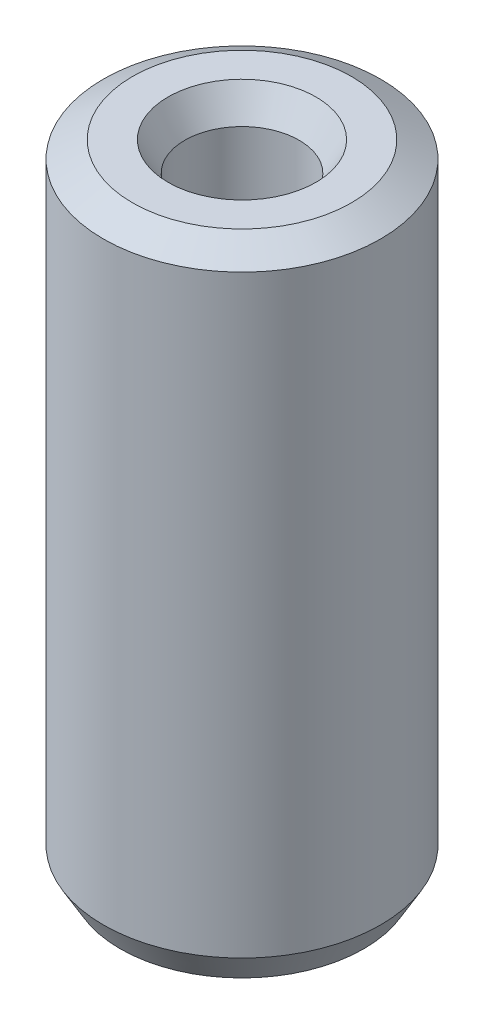
ISO-10303-21;
HEADER;
FILE_DESCRIPTION(('STEP AP214'),'2;1');
FILE_NAME('part.step','',(''),(''),'','','');
FILE_SCHEMA(('AUTOMOTIVE_DESIGN { 1 0 10303 214 1 1 1 1 }'));
ENDSEC;
DATA;
#1=APPLICATION_CONTEXT('core data for automotive mechanical design processes');
#2=APPLICATION_PROTOCOL_DEFINITION('international standard','automotive_design',2000,#1);
#3=PRODUCT_CONTEXT('',#1,'mechanical');
#4=PRODUCT('Part','Part','',(#3));
#5=PRODUCT_RELATED_PRODUCT_CATEGORY('part','',(#4));
#6=PRODUCT_DEFINITION_FORMATION('','',#4);
#7=PRODUCT_DEFINITION_CONTEXT('part definition',#1,'design');
#8=PRODUCT_DEFINITION('design','',#6,#7);
#9=PRODUCT_DEFINITION_SHAPE('','',#8);
#10=(LENGTH_UNIT() NAMED_UNIT(*) SI_UNIT(.MILLI.,.METRE.));
#11=(NAMED_UNIT(*) PLANE_ANGLE_UNIT() SI_UNIT($,.RADIAN.));
#12=(NAMED_UNIT(*) SI_UNIT($,.STERADIAN.) SOLID_ANGLE_UNIT());
#13=UNCERTAINTY_MEASURE_WITH_UNIT(LENGTH_MEASURE(1.E-05),#10,'distance_accuracy_value','');
#14=(GEOMETRIC_REPRESENTATION_CONTEXT(3) GLOBAL_UNCERTAINTY_ASSIGNED_CONTEXT((#13)) GLOBAL_UNIT_ASSIGNED_CONTEXT((#10,
#11,#12)) REPRESENTATION_CONTEXT('',''));
#15=CARTESIAN_POINT('',(0.,0.,0.));
#16=DIRECTION('',(0.,0.,1.));
#17=DIRECTION('',(1.,0.,0.));
#18=AXIS2_PLACEMENT_3D('',#15,#16,#17);
#19=CARTESIAN_POINT('',(0.,103.908366385566,0.));
#20=DIRECTION('',(0.,-1.,0.));
#21=DIRECTION('',(0.,0.,-1.));
#22=AXIS2_PLACEMENT_3D('',#19,#20,#21);
#23=CYLINDRICAL_SURFACE('',#22,22.5);
#24=CARTESIAN_POINT('',(0.,4.72322288186321,0.));
#25=DIRECTION('',(0.,1.,0.));
#26=DIRECTION('',(0.,0.,1.));
#27=AXIS2_PLACEMENT_3D('',#24,#25,#26);
#28=CIRCLE('',#27,22.5);
#29=CARTESIAN_POINT('',(0.,4.72322288186321,22.5));
#30=VERTEX_POINT('',#29);
#31=EDGE_CURVE('E10',#30,#30,#28,.T.);
#32=ORIENTED_EDGE('',*,*,#31,.T.);
#33=EDGE_LOOP('',(#32));
#34=FACE_BOUND('',#33,.T.);
#35=CARTESIAN_POINT('',(0.,101.18141238328,0.));
#36=DIRECTION('',(0.,1.,0.));
#37=DIRECTION('',(0.,0.,1.));
#38=AXIS2_PLACEMENT_3D('',#35,#36,#37);
#39=CIRCLE('',#38,22.5);
#40=CARTESIAN_POINT('',(0.,101.18141238328,22.5));
#41=VERTEX_POINT('',#40);
#42=EDGE_CURVE('E50',#41,#41,#39,.F.);
#43=ORIENTED_EDGE('',*,*,#42,.T.);
#44=EDGE_LOOP('',(#43));
#45=FACE_BOUND('',#44,.T.);
#46=ADVANCED_FACE('F39',(#34,#45),#23,.T.);
#47=CARTESIAN_POINT('',(0.,103.908366385566,0.));
#48=DIRECTION('',(0.,1.,0.));
#49=DIRECTION('',(0.,0.,1.));
#50=AXIS2_PLACEMENT_3D('',#47,#48,#49);
#51=PLANE('',#50);
#52=CARTESIAN_POINT('',(0.,103.908366385566,0.));
#53=DIRECTION('',(0.,1.,0.));
#54=DIRECTION('',(0.,0.,1.));
#55=AXIS2_PLACEMENT_3D('',#52,#53,#54);
#56=CIRCLE('',#55,12.0135149253613);
#57=CARTESIAN_POINT('',(0.,103.908366385566,12.0135149253613));
#58=VERTEX_POINT('',#57);
#59=EDGE_CURVE('E58',#58,#58,#56,.F.);
#60=ORIENTED_EDGE('',*,*,#59,.T.);
#61=EDGE_LOOP('',(#60));
#62=FACE_BOUND('',#61,.T.);
#63=CARTESIAN_POINT('',(0.,103.908366385566,0.));
#64=DIRECTION('',(0.,1.,0.));
#65=DIRECTION('',(0.,0.,1.));
#66=AXIS2_PLACEMENT_3D('',#63,#64,#65);
#67=CIRCLE('',#66,17.7767771181368);
#68=CARTESIAN_POINT('',(0.,103.908366385566,17.7767771181368));
#69=VERTEX_POINT('',#68);
#70=EDGE_CURVE('E61',#69,#69,#67,.T.);
#71=ORIENTED_EDGE('',*,*,#70,.T.);
#72=EDGE_LOOP('',(#71));
#73=FACE_BOUND('',#72,.T.);
#74=ADVANCED_FACE('F88',(#62,#73),#51,.T.);
#75=CARTESIAN_POINT('',(0.,0.,0.));
#76=DIRECTION('',(0.,1.,0.));
#77=DIRECTION('',(0.,0.,1.));
#78=AXIS2_PLACEMENT_3D('',#75,#76,#77);
#79=PLANE('',#78);
#80=CARTESIAN_POINT('',(0.,0.,0.));
#81=DIRECTION('',(0.,1.,0.));
#82=DIRECTION('',(0.,0.,1.));
#83=AXIS2_PLACEMENT_3D('',#80,#81,#82);
#84=CIRCLE('',#83,14.0097838049382);
#85=CARTESIAN_POINT('',(0.,0.,14.0097838049382));
#86=VERTEX_POINT('',#85);
#87=EDGE_CURVE('E51',#86,#86,#84,.T.);
#88=ORIENTED_EDGE('',*,*,#87,.T.);
#89=EDGE_LOOP('',(#88));
#90=FACE_BOUND('',#89,.T.);
#91=CARTESIAN_POINT('',(0.,0.,0.));
#92=DIRECTION('',(0.,1.,0.));
#93=DIRECTION('',(0.,0.,1.));
#94=AXIS2_PLACEMENT_3D('',#91,#92,#93);
#95=CIRCLE('',#94,19.7730459977137);
#96=CARTESIAN_POINT('',(0.,0.,19.7730459977137));
#97=VERTEX_POINT('',#96);
#98=EDGE_CURVE('E54',#97,#97,#95,.F.);
#99=ORIENTED_EDGE('',*,*,#98,.T.);
#100=EDGE_LOOP('',(#99));
#101=FACE_BOUND('',#100,.T.);
#102=ADVANCED_FACE('F83',(#90,#101),#79,.F.);
#103=CARTESIAN_POINT('',(0.,103.908366385566,0.));
#104=DIRECTION('',(0.,-1.,0.));
#105=DIRECTION('',(0.,0.,-1.));
#106=AXIS2_PLACEMENT_3D('',#103,#104,#105);
#107=CYLINDRICAL_SURFACE('',#106,9.28656092307496);
#108=CARTESIAN_POINT('',(0.,99.1851435037029,0.));
#109=DIRECTION('',(0.,1.,0.));
#110=DIRECTION('',(0.,0.,1.));
#111=AXIS2_PLACEMENT_3D('',#108,#109,#110);
#112=CIRCLE('',#111,9.28656092307496);
#113=CARTESIAN_POINT('',(0.,99.1851435037029,9.28656092307496));
#114=VERTEX_POINT('',#113);
#115=EDGE_CURVE('E67',#114,#114,#112,.T.);
#116=ORIENTED_EDGE('',*,*,#115,.T.);
#117=EDGE_LOOP('',(#116));
#118=FACE_BOUND('',#117,.T.);
#119=CARTESIAN_POINT('',(0.,2.72695400228634,0.));
#120=DIRECTION('',(0.,1.,0.));
#121=DIRECTION('',(0.,0.,1.));
#122=AXIS2_PLACEMENT_3D('',#119,#120,#121);
#123=CIRCLE('',#122,9.28656092307496);
#124=CARTESIAN_POINT('',(0.,2.72695400228634,9.28656092307496));
#125=VERTEX_POINT('',#124);
#126=EDGE_CURVE('E69',#125,#125,#123,.F.);
#127=ORIENTED_EDGE('',*,*,#126,.T.);
#128=EDGE_LOOP('',(#127));
#129=FACE_BOUND('',#128,.T.);
#130=ADVANCED_FACE('F71',(#118,#129),#107,.F.);
#131=CARTESIAN_POINT('',(0.,99.1851435037029,0.));
#132=DIRECTION('',(0.,1.,0.));
#133=DIRECTION('',(0.,0.,1.));
#134=AXIS2_PLACEMENT_3D('',#131,#132,#133);
#135=CONICAL_SURFACE('',#134,9.28656092307496,0.523598775598305);
#136=ORIENTED_EDGE('',*,*,#59,.F.);
#137=EDGE_LOOP('',(#136));
#138=FACE_BOUND('',#137,.T.);
#139=ORIENTED_EDGE('',*,*,#115,.F.);
#140=EDGE_LOOP('',(#139));
#141=FACE_BOUND('',#140,.T.);
#142=ADVANCED_FACE('F77',(#138,#141),#135,.F.);
#143=CARTESIAN_POINT('',(0.,0.,0.));
#144=DIRECTION('',(0.,-1.,0.));
#145=DIRECTION('',(0.,0.,-1.));
#146=AXIS2_PLACEMENT_3D('',#143,#144,#145);
#147=CONICAL_SURFACE('',#146,14.0097838049382,1.0471975511966);
#148=ORIENTED_EDGE('',*,*,#126,.F.);
#149=EDGE_LOOP('',(#148));
#150=FACE_BOUND('',#149,.T.);
#151=ORIENTED_EDGE('',*,*,#87,.F.);
#152=EDGE_LOOP('',(#151));
#153=FACE_BOUND('',#152,.T.);
#154=ADVANCED_FACE('F73',(#150,#153),#147,.F.);
#155=CARTESIAN_POINT('',(0.,4.72322288186321,0.));
#156=DIRECTION('',(0.,1.,0.));
#157=DIRECTION('',(0.,0.,1.));
#158=AXIS2_PLACEMENT_3D('',#155,#156,#157);
#159=CONICAL_SURFACE('',#158,22.5,0.523598775598302);
#160=ORIENTED_EDGE('',*,*,#98,.F.);
#161=EDGE_LOOP('',(#160));
#162=FACE_BOUND('',#161,.T.);
#163=ORIENTED_EDGE('',*,*,#31,.F.);
#164=EDGE_LOOP('',(#163));
#165=FACE_BOUND('',#164,.T.);
#166=ADVANCED_FACE('F76',(#162,#165),#159,.T.);
#167=CARTESIAN_POINT('',(0.,103.908366385566,0.));
#168=DIRECTION('',(0.,-1.,0.));
#169=DIRECTION('',(0.,0.,-1.));
#170=AXIS2_PLACEMENT_3D('',#167,#168,#169);
#171=CONICAL_SURFACE('',#170,17.7767771181368,1.04719755119659);
#172=ORIENTED_EDGE('',*,*,#42,.F.);
#173=EDGE_LOOP('',(#172));
#174=FACE_BOUND('',#173,.T.);
#175=ORIENTED_EDGE('',*,*,#70,.F.);
#176=EDGE_LOOP('',(#175));
#177=FACE_BOUND('',#176,.T.);
#178=ADVANCED_FACE('F45',(#174,#177),#171,.T.);
#179=CLOSED_SHELL('',(#46,#74,#102,#130,#142,#154,#166,#178));
#180=MANIFOLD_SOLID_BREP('B2',#179);
#181=ADVANCED_BREP_SHAPE_REPRESENTATION('',(#18,#180),#14);
#182=SHAPE_DEFINITION_REPRESENTATION(#9,#181);
ENDSEC;
END-ISO-10303-21;
